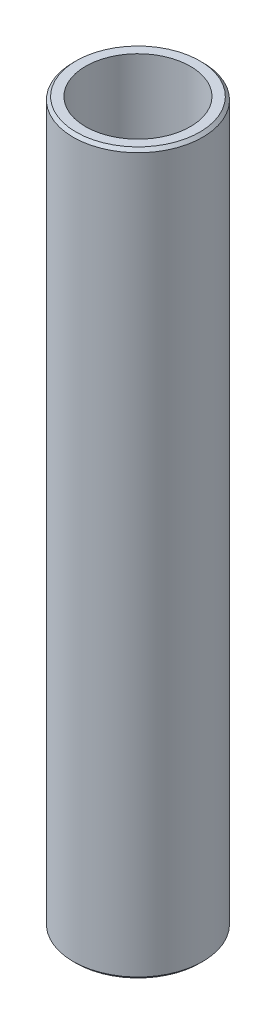
ISO-10303-21;
HEADER;
FILE_DESCRIPTION(('STEP AP214'),'2;1');
FILE_NAME('part.step','',(''),(''),'','','');
FILE_SCHEMA(('AUTOMOTIVE_DESIGN { 1 0 10303 214 1 1 1 1 }'));
ENDSEC;
DATA;
#1=APPLICATION_CONTEXT('core data for automotive mechanical design processes');
#2=APPLICATION_PROTOCOL_DEFINITION('international standard','automotive_design',2000,#1);
#3=PRODUCT_CONTEXT('',#1,'mechanical');
#4=PRODUCT('Part','Part','',(#3));
#5=PRODUCT_RELATED_PRODUCT_CATEGORY('part','',(#4));
#6=PRODUCT_DEFINITION_FORMATION('','',#4);
#7=PRODUCT_DEFINITION_CONTEXT('part definition',#1,'design');
#8=PRODUCT_DEFINITION('design','',#6,#7);
#9=PRODUCT_DEFINITION_SHAPE('','',#8);
#10=(LENGTH_UNIT() NAMED_UNIT(*) SI_UNIT(.MILLI.,.METRE.));
#11=(NAMED_UNIT(*) PLANE_ANGLE_UNIT() SI_UNIT($,.RADIAN.));
#12=(NAMED_UNIT(*) SI_UNIT($,.STERADIAN.) SOLID_ANGLE_UNIT());
#13=UNCERTAINTY_MEASURE_WITH_UNIT(LENGTH_MEASURE(1.E-05),#10,'distance_accuracy_value','');
#14=(GEOMETRIC_REPRESENTATION_CONTEXT(3) GLOBAL_UNCERTAINTY_ASSIGNED_CONTEXT((#13)) GLOBAL_UNIT_ASSIGNED_CONTEXT((#10,
#11,#12)) REPRESENTATION_CONTEXT('',''));
#15=CARTESIAN_POINT('',(0.,0.,0.));
#16=DIRECTION('',(0.,0.,1.));
#17=DIRECTION('',(1.,0.,0.));
#18=AXIS2_PLACEMENT_3D('',#15,#16,#17);
#19=CARTESIAN_POINT('',(0.,361.180381513155,0.));
#20=DIRECTION('',(0.,-1.,0.));
#21=DIRECTION('',(0.,0.,-1.));
#22=AXIS2_PLACEMENT_3D('',#19,#20,#21);
#23=CYLINDRICAL_SURFACE('',#22,32.5);
#24=CARTESIAN_POINT('',(0.,359.695561077883,0.));
#25=DIRECTION('',(0.,1.,0.));
#26=DIRECTION('',(0.,0.,1.));
#27=AXIS2_PLACEMENT_3D('',#24,#25,#26);
#28=CIRCLE('',#27,32.5);
#29=CARTESIAN_POINT('',(0.,359.695561077883,32.5));
#30=VERTEX_POINT('',#29);
#31=EDGE_CURVE('E50',#30,#30,#28,.F.);
#32=ORIENTED_EDGE('',*,*,#31,.T.);
#33=EDGE_LOOP('',(#32));
#34=FACE_BOUND('',#33,.T.);
#35=CARTESIAN_POINT('',(0.,1.48482043527232,0.));
#36=DIRECTION('',(0.,1.,0.));
#37=DIRECTION('',(0.,0.,1.));
#38=AXIS2_PLACEMENT_3D('',#35,#36,#37);
#39=CIRCLE('',#38,32.5);
#40=CARTESIAN_POINT('',(0.,1.48482043527232,32.5));
#41=VERTEX_POINT('',#40);
#42=EDGE_CURVE('E51',#41,#41,#39,.T.);
#43=ORIENTED_EDGE('',*,*,#42,.T.);
#44=EDGE_LOOP('',(#43));
#45=FACE_BOUND('',#44,.T.);
#46=ADVANCED_FACE('F39',(#34,#45),#23,.T.);
#47=CARTESIAN_POINT('',(0.,361.180381513155,0.));
#48=DIRECTION('',(0.,1.,0.));
#49=DIRECTION('',(0.,0.,1.));
#50=AXIS2_PLACEMENT_3D('',#47,#48,#49);
#51=PLANE('',#50);
#52=CARTESIAN_POINT('',(0.,361.180381513155,0.));
#53=DIRECTION('',(0.,1.,0.));
#54=DIRECTION('',(0.,0.,1.));
#55=AXIS2_PLACEMENT_3D('',#52,#53,#54);
#56=CIRCLE('',#55,31.0151795647275);
#57=CARTESIAN_POINT('',(0.,361.180381513155,31.0151795647275));
#58=VERTEX_POINT('',#57);
#59=EDGE_CURVE('E54',#58,#58,#56,.T.);
#60=ORIENTED_EDGE('',*,*,#59,.T.);
#61=EDGE_LOOP('',(#60));
#62=FACE_BOUND('',#61,.T.);
#63=CARTESIAN_POINT('',(0.,361.180381513155,0.));
#64=DIRECTION('',(0.,1.,0.));
#65=DIRECTION('',(0.,0.,1.));
#66=AXIS2_PLACEMENT_3D('',#63,#64,#65);
#67=CIRCLE('',#66,26.2833356442432);
#68=CARTESIAN_POINT('',(0.,361.180381513155,26.2833356442432));
#69=VERTEX_POINT('',#68);
#70=EDGE_CURVE('E58',#69,#69,#67,.T.);
#71=ORIENTED_EDGE('',*,*,#70,.F.);
#72=EDGE_LOOP('',(#71));
#73=FACE_BOUND('',#72,.T.);
#74=ADVANCED_FACE('F69',(#62,#73),#51,.T.);
#75=CARTESIAN_POINT('',(0.,0.,0.));
#76=DIRECTION('',(0.,1.,0.));
#77=DIRECTION('',(0.,0.,1.));
#78=AXIS2_PLACEMENT_3D('',#75,#76,#77);
#79=PLANE('',#78);
#80=CARTESIAN_POINT('',(0.,0.,0.));
#81=DIRECTION('',(0.,1.,0.));
#82=DIRECTION('',(0.,0.,1.));
#83=AXIS2_PLACEMENT_3D('',#80,#81,#82);
#84=CIRCLE('',#83,31.0151795647277);
#85=CARTESIAN_POINT('',(0.,0.,31.0151795647277));
#86=VERTEX_POINT('',#85);
#87=EDGE_CURVE('E10',#86,#86,#84,.F.);
#88=ORIENTED_EDGE('',*,*,#87,.T.);
#89=EDGE_LOOP('',(#88));
#90=FACE_BOUND('',#89,.T.);
#91=CARTESIAN_POINT('',(0.,0.,0.));
#92=DIRECTION('',(0.,1.,0.));
#93=DIRECTION('',(0.,0.,1.));
#94=AXIS2_PLACEMENT_3D('',#91,#92,#93);
#95=CIRCLE('',#94,26.2833356442432);
#96=CARTESIAN_POINT('',(0.,0.,26.2833356442432));
#97=VERTEX_POINT('',#96);
#98=EDGE_CURVE('E63',#97,#97,#95,.T.);
#99=ORIENTED_EDGE('',*,*,#98,.T.);
#100=EDGE_LOOP('',(#99));
#101=FACE_BOUND('',#100,.T.);
#102=ADVANCED_FACE('F75',(#90,#101),#79,.F.);
#103=CARTESIAN_POINT('',(0.,361.180381513155,0.));
#104=DIRECTION('',(0.,-1.,0.));
#105=DIRECTION('',(0.,0.,-1.));
#106=AXIS2_PLACEMENT_3D('',#103,#104,#105);
#107=CYLINDRICAL_SURFACE('',#106,26.2833356442432);
#108=ORIENTED_EDGE('',*,*,#70,.T.);
#109=EDGE_LOOP('',(#108));
#110=FACE_BOUND('',#109,.T.);
#111=ORIENTED_EDGE('',*,*,#98,.F.);
#112=EDGE_LOOP('',(#111));
#113=FACE_BOUND('',#112,.T.);
#114=ADVANCED_FACE('F70',(#110,#113),#107,.F.);
#115=CARTESIAN_POINT('',(0.,361.180381513155,0.));
#116=DIRECTION('',(0.,-1.,0.));
#117=DIRECTION('',(0.,0.,-1.));
#118=AXIS2_PLACEMENT_3D('',#115,#116,#117);
#119=CONICAL_SURFACE('',#118,31.0151795647275,0.785398163397439);
#120=ORIENTED_EDGE('',*,*,#31,.F.);
#121=EDGE_LOOP('',(#120));
#122=FACE_BOUND('',#121,.T.);
#123=ORIENTED_EDGE('',*,*,#59,.F.);
#124=EDGE_LOOP('',(#123));
#125=FACE_BOUND('',#124,.T.);
#126=ADVANCED_FACE('F81',(#122,#125),#119,.T.);
#127=CARTESIAN_POINT('',(0.,1.48482043527232,0.));
#128=DIRECTION('',(0.,1.,0.));
#129=DIRECTION('',(0.,0.,1.));
#130=AXIS2_PLACEMENT_3D('',#127,#128,#129);
#131=CONICAL_SURFACE('',#130,32.5,0.785398163397458);
#132=ORIENTED_EDGE('',*,*,#87,.F.);
#133=EDGE_LOOP('',(#132));
#134=FACE_BOUND('',#133,.T.);
#135=ORIENTED_EDGE('',*,*,#42,.F.);
#136=EDGE_LOOP('',(#135));
#137=FACE_BOUND('',#136,.T.);
#138=ADVANCED_FACE('F45',(#134,#137),#131,.T.);
#139=CLOSED_SHELL('',(#46,#74,#102,#114,#126,#138));
#140=MANIFOLD_SOLID_BREP('B2',#139);
#141=ADVANCED_BREP_SHAPE_REPRESENTATION('',(#18,#140),#14);
#142=SHAPE_DEFINITION_REPRESENTATION(#9,#141);
ENDSEC;
END-ISO-10303-21;
